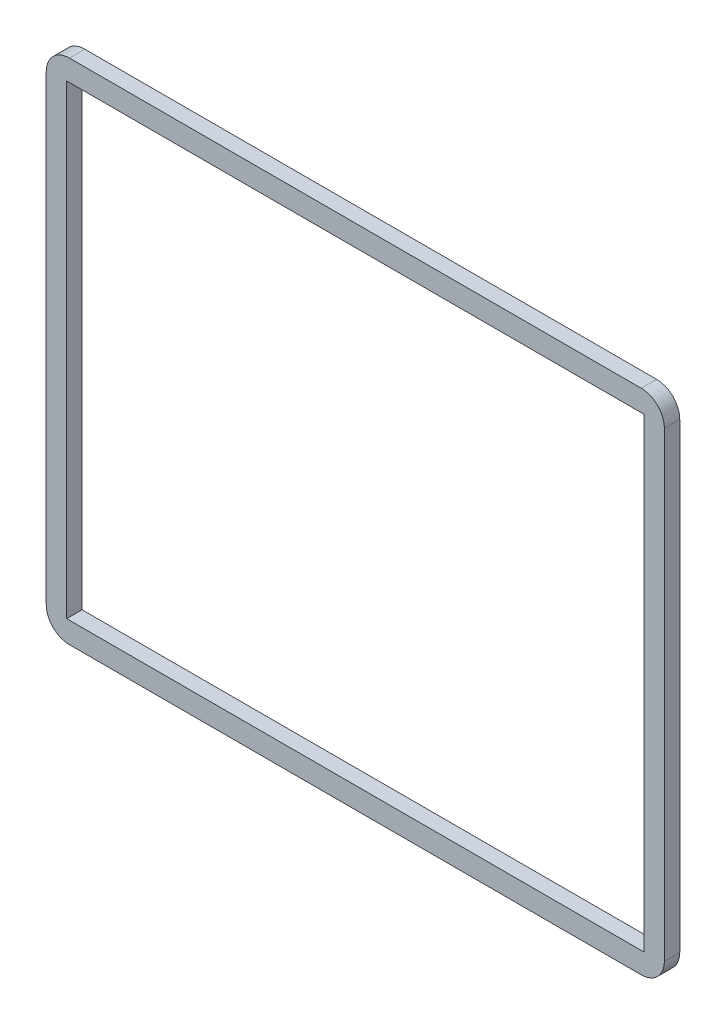
ISO-10303-21;
HEADER;
FILE_DESCRIPTION(('STEP AP214'),'2;1');
FILE_NAME('part.step','',(''),(''),'','','');
FILE_SCHEMA(('AUTOMOTIVE_DESIGN { 1 0 10303 214 1 1 1 1 }'));
ENDSEC;
DATA;
#1=APPLICATION_CONTEXT('core data for automotive mechanical design processes');
#2=APPLICATION_PROTOCOL_DEFINITION('international standard','automotive_design',2000,#1);
#3=PRODUCT_CONTEXT('',#1,'mechanical');
#4=PRODUCT('Part','Part','',(#3));
#5=PRODUCT_RELATED_PRODUCT_CATEGORY('part','',(#4));
#6=PRODUCT_DEFINITION_FORMATION('','',#4);
#7=PRODUCT_DEFINITION_CONTEXT('part definition',#1,'design');
#8=PRODUCT_DEFINITION('design','',#6,#7);
#9=PRODUCT_DEFINITION_SHAPE('','',#8);
#10=(LENGTH_UNIT() NAMED_UNIT(*) SI_UNIT(.MILLI.,.METRE.));
#11=(NAMED_UNIT(*) PLANE_ANGLE_UNIT() SI_UNIT($,.RADIAN.));
#12=(NAMED_UNIT(*) SI_UNIT($,.STERADIAN.) SOLID_ANGLE_UNIT());
#13=UNCERTAINTY_MEASURE_WITH_UNIT(LENGTH_MEASURE(1.E-05),#10,'distance_accuracy_value','');
#14=(GEOMETRIC_REPRESENTATION_CONTEXT(3) GLOBAL_UNCERTAINTY_ASSIGNED_CONTEXT((#13)) GLOBAL_UNIT_ASSIGNED_CONTEXT((#10,
#11,#12)) REPRESENTATION_CONTEXT('',''));
#15=CARTESIAN_POINT('',(0.,0.,0.));
#16=DIRECTION('',(0.,0.,1.));
#17=DIRECTION('',(1.,0.,0.));
#18=AXIS2_PLACEMENT_3D('',#15,#16,#17);
#19=CARTESIAN_POINT('',(0.,0.,2.));
#20=DIRECTION('',(1.,0.,0.));
#21=DIRECTION('',(0.,0.,-1.));
#22=AXIS2_PLACEMENT_3D('',#19,#20,#21);
#23=PLANE('',#22);
#24=DIRECTION('',(0.,-1.,0.));
#25=VECTOR('',#24,1.);
#26=CARTESIAN_POINT('',(0.,0.,0.));
#27=LINE('',#26,#25);
#28=CARTESIAN_POINT('',(0.,63.,0.));
#29=VERTEX_POINT('',#28);
#30=CARTESIAN_POINT('',(0.,3.,0.));
#31=VERTEX_POINT('',#30);
#32=EDGE_CURVE('E154',#29,#31,#27,.T.);
#33=ORIENTED_EDGE('',*,*,#32,.T.);
#34=DIRECTION('',(0.,0.,-1.));
#35=VECTOR('',#34,1.);
#36=CARTESIAN_POINT('',(0.,3.,2.));
#37=LINE('',#36,#35);
#38=CARTESIAN_POINT('',(0.,3.,2.));
#39=VERTEX_POINT('',#38);
#40=EDGE_CURVE('E11',#31,#39,#37,.F.);
#41=ORIENTED_EDGE('',*,*,#40,.T.);
#42=DIRECTION('',(0.,-1.,0.));
#43=VECTOR('',#42,1.);
#44=CARTESIAN_POINT('',(0.,0.,2.));
#45=LINE('',#44,#43);
#46=CARTESIAN_POINT('',(0.,63.,2.));
#47=VERTEX_POINT('',#46);
#48=EDGE_CURVE('E158',#47,#39,#45,.T.);
#49=ORIENTED_EDGE('',*,*,#48,.F.);
#50=DIRECTION('',(0.,0.,-1.));
#51=VECTOR('',#50,1.);
#52=CARTESIAN_POINT('',(0.,63.,2.));
#53=LINE('',#52,#51);
#54=EDGE_CURVE('E41',#47,#29,#53,.T.);
#55=ORIENTED_EDGE('',*,*,#54,.T.);
#56=EDGE_LOOP('',(#33,#41,#49,#55));
#57=FACE_BOUND('',#56,.T.);
#58=ADVANCED_FACE('F33',(#57),#23,.F.);
#59=CARTESIAN_POINT('',(0.,0.,2.));
#60=DIRECTION('',(0.,1.,0.));
#61=DIRECTION('',(0.,0.,1.));
#62=AXIS2_PLACEMENT_3D('',#59,#60,#61);
#63=PLANE('',#62);
#64=DIRECTION('',(1.,0.,0.));
#65=VECTOR('',#64,1.);
#66=CARTESIAN_POINT('',(0.,0.,0.));
#67=LINE('',#66,#65);
#68=CARTESIAN_POINT('',(3.,0.,0.));
#69=VERTEX_POINT('',#68);
#70=CARTESIAN_POINT('',(77.3,0.,0.));
#71=VERTEX_POINT('',#70);
#72=EDGE_CURVE('E174',#69,#71,#67,.T.);
#73=ORIENTED_EDGE('',*,*,#72,.T.);
#74=DIRECTION('',(0.,0.,-1.));
#75=VECTOR('',#74,1.);
#76=CARTESIAN_POINT('',(77.3,0.,2.));
#77=LINE('',#76,#75);
#78=CARTESIAN_POINT('',(77.3,0.,2.));
#79=VERTEX_POINT('',#78);
#80=EDGE_CURVE('E210',#71,#79,#77,.F.);
#81=ORIENTED_EDGE('',*,*,#80,.T.);
#82=DIRECTION('',(1.,0.,0.));
#83=VECTOR('',#82,1.);
#84=CARTESIAN_POINT('',(0.,0.,2.));
#85=LINE('',#84,#83);
#86=CARTESIAN_POINT('',(3.,0.,2.));
#87=VERTEX_POINT('',#86);
#88=EDGE_CURVE('E161',#87,#79,#85,.T.);
#89=ORIENTED_EDGE('',*,*,#88,.F.);
#90=DIRECTION('',(0.,0.,-1.));
#91=VECTOR('',#90,1.);
#92=CARTESIAN_POINT('',(3.,0.,2.));
#93=LINE('',#92,#91);
#94=EDGE_CURVE('E207',#87,#69,#93,.T.);
#95=ORIENTED_EDGE('',*,*,#94,.T.);
#96=EDGE_LOOP('',(#73,#81,#89,#95));
#97=FACE_BOUND('',#96,.T.);
#98=ADVANCED_FACE('F227',(#97),#63,.F.);
#99=CARTESIAN_POINT('',(80.3,0.,2.));
#100=DIRECTION('',(-1.,0.,0.));
#101=DIRECTION('',(0.,0.,1.));
#102=AXIS2_PLACEMENT_3D('',#99,#100,#101);
#103=PLANE('',#102);
#104=DIRECTION('',(0.,1.,0.));
#105=VECTOR('',#104,1.);
#106=CARTESIAN_POINT('',(80.3,0.,0.));
#107=LINE('',#106,#105);
#108=CARTESIAN_POINT('',(80.3,3.,0.));
#109=VERTEX_POINT('',#108);
#110=CARTESIAN_POINT('',(80.3,63.,0.));
#111=VERTEX_POINT('',#110);
#112=EDGE_CURVE('E177',#109,#111,#107,.T.);
#113=ORIENTED_EDGE('',*,*,#112,.T.);
#114=DIRECTION('',(0.,0.,-1.));
#115=VECTOR('',#114,1.);
#116=CARTESIAN_POINT('',(80.3,63.,2.));
#117=LINE('',#116,#115);
#118=CARTESIAN_POINT('',(80.3,63.,2.));
#119=VERTEX_POINT('',#118);
#120=EDGE_CURVE('E197',#111,#119,#117,.F.);
#121=ORIENTED_EDGE('',*,*,#120,.T.);
#122=DIRECTION('',(0.,1.,0.));
#123=VECTOR('',#122,1.);
#124=CARTESIAN_POINT('',(80.3,0.,2.));
#125=LINE('',#124,#123);
#126=CARTESIAN_POINT('',(80.3,3.,2.));
#127=VERTEX_POINT('',#126);
#128=EDGE_CURVE('E165',#127,#119,#125,.T.);
#129=ORIENTED_EDGE('',*,*,#128,.F.);
#130=DIRECTION('',(0.,0.,-1.));
#131=VECTOR('',#130,1.);
#132=CARTESIAN_POINT('',(80.3,3.,2.));
#133=LINE('',#132,#131);
#134=EDGE_CURVE('E194',#127,#109,#133,.T.);
#135=ORIENTED_EDGE('',*,*,#134,.T.);
#136=EDGE_LOOP('',(#113,#121,#129,#135));
#137=FACE_BOUND('',#136,.T.);
#138=ADVANCED_FACE('F238',(#137),#103,.F.);
#139=CARTESIAN_POINT('',(0.,66.,2.));
#140=DIRECTION('',(0.,-1.,0.));
#141=DIRECTION('',(0.,0.,-1.));
#142=AXIS2_PLACEMENT_3D('',#139,#140,#141);
#143=PLANE('',#142);
#144=DIRECTION('',(-1.,0.,0.));
#145=VECTOR('',#144,1.);
#146=CARTESIAN_POINT('',(0.,66.,2.));
#147=LINE('',#146,#145);
#148=CARTESIAN_POINT('',(77.3,66.,2.));
#149=VERTEX_POINT('',#148);
#150=CARTESIAN_POINT('',(3.,66.,2.));
#151=VERTEX_POINT('',#150);
#152=EDGE_CURVE('E168',#149,#151,#147,.T.);
#153=ORIENTED_EDGE('',*,*,#152,.F.);
#154=DIRECTION('',(0.,0.,-1.));
#155=VECTOR('',#154,1.);
#156=CARTESIAN_POINT('',(77.3,66.,2.));
#157=LINE('',#156,#155);
#158=CARTESIAN_POINT('',(77.3,66.,0.));
#159=VERTEX_POINT('',#158);
#160=EDGE_CURVE('E183',#149,#159,#157,.T.);
#161=ORIENTED_EDGE('',*,*,#160,.T.);
#162=DIRECTION('',(-1.,0.,0.));
#163=VECTOR('',#162,1.);
#164=CARTESIAN_POINT('',(0.,66.,0.));
#165=LINE('',#164,#163);
#166=CARTESIAN_POINT('',(3.,66.,0.));
#167=VERTEX_POINT('',#166);
#168=EDGE_CURVE('E162',#159,#167,#165,.T.);
#169=ORIENTED_EDGE('',*,*,#168,.T.);
#170=DIRECTION('',(0.,0.,-1.));
#171=VECTOR('',#170,1.);
#172=CARTESIAN_POINT('',(3.,66.,2.));
#173=LINE('',#172,#171);
#174=EDGE_CURVE('E171',#167,#151,#173,.F.);
#175=ORIENTED_EDGE('',*,*,#174,.T.);
#176=EDGE_LOOP('',(#153,#161,#169,#175));
#177=FACE_BOUND('',#176,.T.);
#178=ADVANCED_FACE('F246',(#177),#143,.F.);
#179=CARTESIAN_POINT('',(0.,0.,2.));
#180=DIRECTION('',(0.,0.,-1.));
#181=DIRECTION('',(-1.,0.,0.));
#182=AXIS2_PLACEMENT_3D('',#179,#180,#181);
#183=PLANE('',#182);
#184=DIRECTION('',(1.,0.,0.));
#185=VECTOR('',#184,1.);
#186=CARTESIAN_POINT('',(2.65000000000001,2.75,2.));
#187=LINE('',#186,#185);
#188=CARTESIAN_POINT('',(2.65000000000001,2.75,2.));
#189=VERTEX_POINT('',#188);
#190=CARTESIAN_POINT('',(77.65,2.75000000000001,2.));
#191=VERTEX_POINT('',#190);
#192=EDGE_CURVE('E148',#189,#191,#187,.T.);
#193=ORIENTED_EDGE('',*,*,#192,.F.);
#194=DIRECTION('',(0.,-1.,0.));
#195=VECTOR('',#194,1.);
#196=CARTESIAN_POINT('',(2.65000000000001,2.75,2.));
#197=LINE('',#196,#195);
#198=CARTESIAN_POINT('',(2.65000000000001,63.25,2.));
#199=VERTEX_POINT('',#198);
#200=EDGE_CURVE('E48',#199,#189,#197,.T.);
#201=ORIENTED_EDGE('',*,*,#200,.F.);
#202=DIRECTION('',(-1.,0.,0.));
#203=VECTOR('',#202,1.);
#204=CARTESIAN_POINT('',(2.65000000000001,63.25,2.));
#205=LINE('',#204,#203);
#206=CARTESIAN_POINT('',(77.65,63.25,2.));
#207=VERTEX_POINT('',#206);
#208=EDGE_CURVE('E139',#207,#199,#205,.T.);
#209=ORIENTED_EDGE('',*,*,#208,.F.);
#210=DIRECTION('',(0.,1.,0.));
#211=VECTOR('',#210,1.);
#212=CARTESIAN_POINT('',(77.65,2.75000000000001,2.));
#213=LINE('',#212,#211);
#214=EDGE_CURVE('E142',#191,#207,#213,.T.);
#215=ORIENTED_EDGE('',*,*,#214,.F.);
#216=EDGE_LOOP('',(#193,#201,#209,#215));
#217=FACE_BOUND('',#216,.T.);
#218=ORIENTED_EDGE('',*,*,#128,.T.);
#219=CARTESIAN_POINT('',(77.3,63.,2.));
#220=DIRECTION('',(0.,0.,-1.));
#221=DIRECTION('',(-1.,0.,0.));
#222=AXIS2_PLACEMENT_3D('',#219,#220,#221);
#223=CIRCLE('',#222,3.);
#224=EDGE_CURVE('E205',#119,#149,#223,.F.);
#225=ORIENTED_EDGE('',*,*,#224,.T.);
#226=ORIENTED_EDGE('',*,*,#152,.T.);
#227=CARTESIAN_POINT('',(3.,63.,2.));
#228=DIRECTION('',(0.,0.,-1.));
#229=DIRECTION('',(-1.,0.,0.));
#230=AXIS2_PLACEMENT_3D('',#227,#228,#229);
#231=CIRCLE('',#230,3.);
#232=EDGE_CURVE('E199',#151,#47,#231,.F.);
#233=ORIENTED_EDGE('',*,*,#232,.T.);
#234=ORIENTED_EDGE('',*,*,#48,.T.);
#235=CARTESIAN_POINT('',(3.,3.,2.));
#236=DIRECTION('',(0.,0.,-1.));
#237=DIRECTION('',(-1.,0.,0.));
#238=AXIS2_PLACEMENT_3D('',#235,#236,#237);
#239=CIRCLE('',#238,3.);
#240=EDGE_CURVE('E201',#39,#87,#239,.F.);
#241=ORIENTED_EDGE('',*,*,#240,.T.);
#242=ORIENTED_EDGE('',*,*,#88,.T.);
#243=CARTESIAN_POINT('',(77.3,3.,2.));
#244=DIRECTION('',(0.,0.,-1.));
#245=DIRECTION('',(-1.,0.,0.));
#246=AXIS2_PLACEMENT_3D('',#243,#244,#245);
#247=CIRCLE('',#246,3.);
#248=EDGE_CURVE('E203',#79,#127,#247,.F.);
#249=ORIENTED_EDGE('',*,*,#248,.T.);
#250=EDGE_LOOP('',(#218,#225,#226,#233,#234,#241,#242,#249));
#251=FACE_BOUND('',#250,.T.);
#252=ADVANCED_FACE('F231',(#217,#251),#183,.F.);
#253=CARTESIAN_POINT('',(0.,0.,0.));
#254=DIRECTION('',(0.,0.,-1.));
#255=DIRECTION('',(-1.,0.,0.));
#256=AXIS2_PLACEMENT_3D('',#253,#254,#255);
#257=PLANE('',#256);
#258=DIRECTION('',(0.,-1.,0.));
#259=VECTOR('',#258,1.);
#260=CARTESIAN_POINT('',(2.65000000000001,2.75,0.));
#261=LINE('',#260,#259);
#262=CARTESIAN_POINT('',(2.65000000000001,63.25,0.));
#263=VERTEX_POINT('',#262);
#264=CARTESIAN_POINT('',(2.65000000000001,2.75,0.));
#265=VERTEX_POINT('',#264);
#266=EDGE_CURVE('E123',#263,#265,#261,.T.);
#267=ORIENTED_EDGE('',*,*,#266,.T.);
#268=DIRECTION('',(1.,0.,0.));
#269=VECTOR('',#268,1.);
#270=CARTESIAN_POINT('',(2.65000000000001,2.75,0.));
#271=LINE('',#270,#269);
#272=CARTESIAN_POINT('',(77.65,2.75000000000001,0.));
#273=VERTEX_POINT('',#272);
#274=EDGE_CURVE('E132',#265,#273,#271,.T.);
#275=ORIENTED_EDGE('',*,*,#274,.T.);
#276=DIRECTION('',(0.,1.,0.));
#277=VECTOR('',#276,1.);
#278=CARTESIAN_POINT('',(77.65,2.75000000000001,0.));
#279=LINE('',#278,#277);
#280=CARTESIAN_POINT('',(77.65,63.25,0.));
#281=VERTEX_POINT('',#280);
#282=EDGE_CURVE('E56',#273,#281,#279,.T.);
#283=ORIENTED_EDGE('',*,*,#282,.T.);
#284=DIRECTION('',(-1.,0.,0.));
#285=VECTOR('',#284,1.);
#286=CARTESIAN_POINT('',(2.65000000000001,63.25,0.));
#287=LINE('',#286,#285);
#288=EDGE_CURVE('E129',#281,#263,#287,.T.);
#289=ORIENTED_EDGE('',*,*,#288,.T.);
#290=EDGE_LOOP('',(#267,#275,#283,#289));
#291=FACE_BOUND('',#290,.T.);
#292=ORIENTED_EDGE('',*,*,#168,.F.);
#293=CARTESIAN_POINT('',(77.3,63.,0.));
#294=DIRECTION('',(0.,0.,-1.));
#295=DIRECTION('',(-1.,0.,0.));
#296=AXIS2_PLACEMENT_3D('',#293,#294,#295);
#297=CIRCLE('',#296,3.);
#298=EDGE_CURVE('E192',#159,#111,#297,.T.);
#299=ORIENTED_EDGE('',*,*,#298,.T.);
#300=ORIENTED_EDGE('',*,*,#112,.F.);
#301=CARTESIAN_POINT('',(77.3,3.,0.));
#302=DIRECTION('',(0.,0.,-1.));
#303=DIRECTION('',(-1.,0.,0.));
#304=AXIS2_PLACEMENT_3D('',#301,#302,#303);
#305=CIRCLE('',#304,3.);
#306=EDGE_CURVE('E190',#109,#71,#305,.T.);
#307=ORIENTED_EDGE('',*,*,#306,.T.);
#308=ORIENTED_EDGE('',*,*,#72,.F.);
#309=CARTESIAN_POINT('',(3.,3.,0.));
#310=DIRECTION('',(0.,0.,-1.));
#311=DIRECTION('',(-1.,0.,0.));
#312=AXIS2_PLACEMENT_3D('',#309,#310,#311);
#313=CIRCLE('',#312,3.);
#314=EDGE_CURVE('E188',#69,#31,#313,.T.);
#315=ORIENTED_EDGE('',*,*,#314,.T.);
#316=ORIENTED_EDGE('',*,*,#32,.F.);
#317=CARTESIAN_POINT('',(3.,63.,0.));
#318=DIRECTION('',(0.,0.,-1.));
#319=DIRECTION('',(-1.,0.,0.));
#320=AXIS2_PLACEMENT_3D('',#317,#318,#319);
#321=CIRCLE('',#320,3.);
#322=EDGE_CURVE('E186',#29,#167,#321,.T.);
#323=ORIENTED_EDGE('',*,*,#322,.T.);
#324=EDGE_LOOP('',(#292,#299,#300,#307,#308,#315,#316,#323));
#325=FACE_BOUND('',#324,.T.);
#326=ADVANCED_FACE('F136',(#291,#325),#257,.T.);
#327=CARTESIAN_POINT('',(77.3,63.,2.));
#328=DIRECTION('',(0.,0.,-1.));
#329=DIRECTION('',(-1.,0.,0.));
#330=AXIS2_PLACEMENT_3D('',#327,#328,#329);
#331=CYLINDRICAL_SURFACE('',#330,3.);
#332=ORIENTED_EDGE('',*,*,#224,.F.);
#333=ORIENTED_EDGE('',*,*,#120,.F.);
#334=ORIENTED_EDGE('',*,*,#298,.F.);
#335=ORIENTED_EDGE('',*,*,#160,.F.);
#336=EDGE_LOOP('',(#332,#333,#334,#335));
#337=FACE_BOUND('',#336,.T.);
#338=ADVANCED_FACE('F243',(#337),#331,.T.);
#339=CARTESIAN_POINT('',(77.3,3.,2.));
#340=DIRECTION('',(0.,0.,-1.));
#341=DIRECTION('',(-1.,0.,0.));
#342=AXIS2_PLACEMENT_3D('',#339,#340,#341);
#343=CYLINDRICAL_SURFACE('',#342,3.);
#344=ORIENTED_EDGE('',*,*,#248,.F.);
#345=ORIENTED_EDGE('',*,*,#80,.F.);
#346=ORIENTED_EDGE('',*,*,#306,.F.);
#347=ORIENTED_EDGE('',*,*,#134,.F.);
#348=EDGE_LOOP('',(#344,#345,#346,#347));
#349=FACE_BOUND('',#348,.T.);
#350=ADVANCED_FACE('F235',(#349),#343,.T.);
#351=CARTESIAN_POINT('',(3.,3.,2.));
#352=DIRECTION('',(0.,0.,-1.));
#353=DIRECTION('',(-1.,0.,0.));
#354=AXIS2_PLACEMENT_3D('',#351,#352,#353);
#355=CYLINDRICAL_SURFACE('',#354,3.);
#356=ORIENTED_EDGE('',*,*,#240,.F.);
#357=ORIENTED_EDGE('',*,*,#40,.F.);
#358=ORIENTED_EDGE('',*,*,#314,.F.);
#359=ORIENTED_EDGE('',*,*,#94,.F.);
#360=EDGE_LOOP('',(#356,#357,#358,#359));
#361=FACE_BOUND('',#360,.T.);
#362=ADVANCED_FACE('F224',(#361),#355,.T.);
#363=CARTESIAN_POINT('',(3.,63.,2.));
#364=DIRECTION('',(0.,0.,-1.));
#365=DIRECTION('',(-1.,0.,0.));
#366=AXIS2_PLACEMENT_3D('',#363,#364,#365);
#367=CYLINDRICAL_SURFACE('',#366,3.);
#368=ORIENTED_EDGE('',*,*,#232,.F.);
#369=ORIENTED_EDGE('',*,*,#174,.F.);
#370=ORIENTED_EDGE('',*,*,#322,.F.);
#371=ORIENTED_EDGE('',*,*,#54,.F.);
#372=EDGE_LOOP('',(#368,#369,#370,#371));
#373=FACE_BOUND('',#372,.T.);
#374=ADVANCED_FACE('F35',(#373),#367,.T.);
#375=CARTESIAN_POINT('',(2.65000000000001,2.75,0.));
#376=DIRECTION('',(-1.,0.,0.));
#377=DIRECTION('',(0.,-1.,0.));
#378=AXIS2_PLACEMENT_3D('',#375,#376,#377);
#379=PLANE('',#378);
#380=ORIENTED_EDGE('',*,*,#200,.T.);
#381=DIRECTION('',(0.,0.,1.));
#382=VECTOR('',#381,1.);
#383=CARTESIAN_POINT('',(2.65000000000001,2.75,0.));
#384=LINE('',#383,#382);
#385=EDGE_CURVE('E119',#265,#189,#384,.T.);
#386=ORIENTED_EDGE('',*,*,#385,.F.);
#387=ORIENTED_EDGE('',*,*,#266,.F.);
#388=DIRECTION('',(0.,0.,1.));
#389=VECTOR('',#388,1.);
#390=CARTESIAN_POINT('',(2.65000000000001,63.25,0.));
#391=LINE('',#390,#389);
#392=EDGE_CURVE('E152',#263,#199,#391,.T.);
#393=ORIENTED_EDGE('',*,*,#392,.T.);
#394=EDGE_LOOP('',(#380,#386,#387,#393));
#395=FACE_BOUND('',#394,.T.);
#396=ADVANCED_FACE('F121',(#395),#379,.F.);
#397=CARTESIAN_POINT('',(2.65000000000001,63.25,0.));
#398=DIRECTION('',(0.,1.,0.));
#399=DIRECTION('',(-1.,0.,0.));
#400=AXIS2_PLACEMENT_3D('',#397,#398,#399);
#401=PLANE('',#400);
#402=ORIENTED_EDGE('',*,*,#208,.T.);
#403=ORIENTED_EDGE('',*,*,#392,.F.);
#404=ORIENTED_EDGE('',*,*,#288,.F.);
#405=DIRECTION('',(0.,0.,1.));
#406=VECTOR('',#405,1.);
#407=CARTESIAN_POINT('',(77.65,63.25,0.));
#408=LINE('',#407,#406);
#409=EDGE_CURVE('E155',#281,#207,#408,.T.);
#410=ORIENTED_EDGE('',*,*,#409,.T.);
#411=EDGE_LOOP('',(#402,#403,#404,#410));
#412=FACE_BOUND('',#411,.T.);
#413=ADVANCED_FACE('F253',(#412),#401,.F.);
#414=CARTESIAN_POINT('',(77.65,2.75000000000001,0.));
#415=DIRECTION('',(1.,0.,0.));
#416=DIRECTION('',(0.,1.,0.));
#417=AXIS2_PLACEMENT_3D('',#414,#415,#416);
#418=PLANE('',#417);
#419=ORIENTED_EDGE('',*,*,#214,.T.);
#420=ORIENTED_EDGE('',*,*,#409,.F.);
#421=ORIENTED_EDGE('',*,*,#282,.F.);
#422=DIRECTION('',(0.,0.,1.));
#423=VECTOR('',#422,1.);
#424=CARTESIAN_POINT('',(77.65,2.75000000000001,0.));
#425=LINE('',#424,#423);
#426=EDGE_CURVE('E128',#273,#191,#425,.T.);
#427=ORIENTED_EDGE('',*,*,#426,.T.);
#428=EDGE_LOOP('',(#419,#420,#421,#427));
#429=FACE_BOUND('',#428,.T.);
#430=ADVANCED_FACE('F313',(#429),#418,.F.);
#431=CARTESIAN_POINT('',(2.65000000000001,2.75,0.));
#432=DIRECTION('',(0.,-1.,0.));
#433=DIRECTION('',(1.,0.,0.));
#434=AXIS2_PLACEMENT_3D('',#431,#432,#433);
#435=PLANE('',#434);
#436=ORIENTED_EDGE('',*,*,#192,.T.);
#437=ORIENTED_EDGE('',*,*,#426,.F.);
#438=ORIENTED_EDGE('',*,*,#274,.F.);
#439=ORIENTED_EDGE('',*,*,#385,.T.);
#440=EDGE_LOOP('',(#436,#437,#438,#439));
#441=FACE_BOUND('',#440,.T.);
#442=ADVANCED_FACE('F133',(#441),#435,.F.);
#443=CLOSED_SHELL('',(#58,#98,#138,#178,#252,#326,#338,#350,#362,#374,#396,#413,#430,#442));
#444=MANIFOLD_SOLID_BREP('B2',#443);
#445=ADVANCED_BREP_SHAPE_REPRESENTATION('',(#18,#444),#14);
#446=SHAPE_DEFINITION_REPRESENTATION(#9,#445);
ENDSEC;
END-ISO-10303-21;
